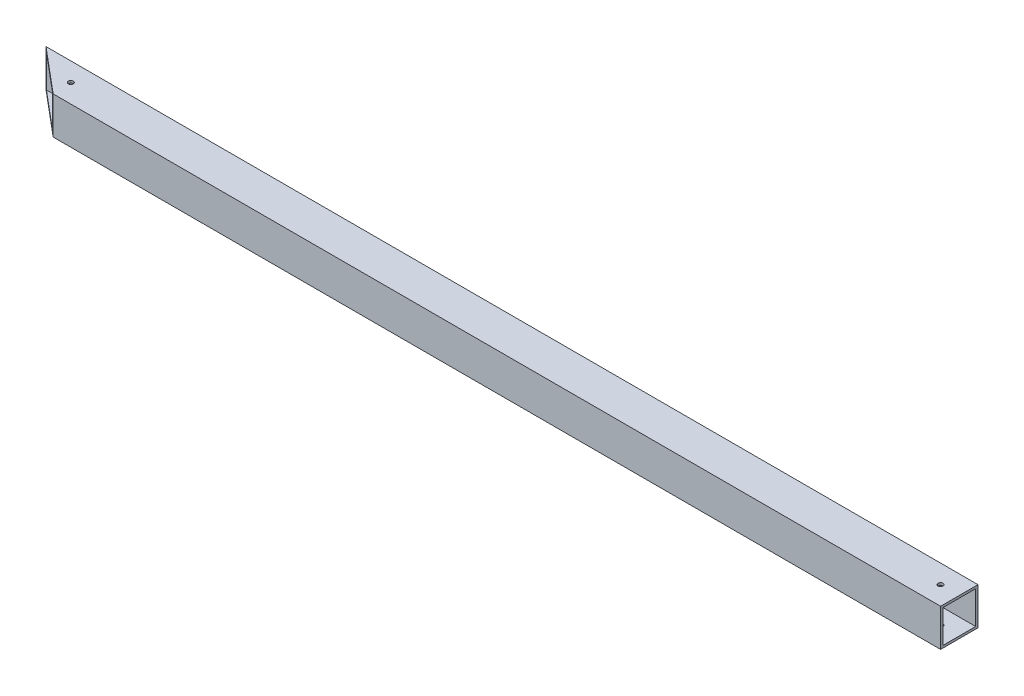
ISO-10303-21;
HEADER;
FILE_DESCRIPTION(('STEP AP214'),'2;1');
FILE_NAME('part.step','',(''),(''),'','','');
FILE_SCHEMA(('AUTOMOTIVE_DESIGN { 1 0 10303 214 1 1 1 1 }'));
ENDSEC;
DATA;
#1=APPLICATION_CONTEXT('core data for automotive mechanical design processes');
#2=APPLICATION_PROTOCOL_DEFINITION('international standard','automotive_design',2000,#1);
#3=PRODUCT_CONTEXT('',#1,'mechanical');
#4=PRODUCT('Part','Part','',(#3));
#5=PRODUCT_RELATED_PRODUCT_CATEGORY('part','',(#4));
#6=PRODUCT_DEFINITION_FORMATION('','',#4);
#7=PRODUCT_DEFINITION_CONTEXT('part definition',#1,'design');
#8=PRODUCT_DEFINITION('design','',#6,#7);
#9=PRODUCT_DEFINITION_SHAPE('','',#8);
#10=(LENGTH_UNIT() NAMED_UNIT(*) SI_UNIT(.MILLI.,.METRE.));
#11=(NAMED_UNIT(*) PLANE_ANGLE_UNIT() SI_UNIT($,.RADIAN.));
#12=(NAMED_UNIT(*) SI_UNIT($,.STERADIAN.) SOLID_ANGLE_UNIT());
#13=UNCERTAINTY_MEASURE_WITH_UNIT(LENGTH_MEASURE(1.E-05),#10,'distance_accuracy_value','');
#14=(GEOMETRIC_REPRESENTATION_CONTEXT(3) GLOBAL_UNCERTAINTY_ASSIGNED_CONTEXT((#13)) GLOBAL_UNIT_ASSIGNED_CONTEXT((#10,
#11,#12)) REPRESENTATION_CONTEXT('',''));
#15=CARTESIAN_POINT('',(0.,0.,0.));
#16=DIRECTION('',(0.,0.,1.));
#17=DIRECTION('',(1.,0.,0.));
#18=AXIS2_PLACEMENT_3D('',#15,#16,#17);
#19=CARTESIAN_POINT('',(1434.71069902318,-215.9,1156.61312053318));
#20=DIRECTION('',(1.,0.,0.));
#21=DIRECTION('',(0.,0.,-1.));
#22=AXIS2_PLACEMENT_3D('',#19,#20,#21);
#23=PLANE('',#22);
#24=DIRECTION('',(0.,0.,-1.));
#25=VECTOR('',#24,1.);
#26=CARTESIAN_POINT('',(1434.71069902318,-165.1,1156.61312053318));
#27=LINE('',#26,#25);
#28=CARTESIAN_POINT('',(1434.71069902318,-165.1,177.8));
#29=VERTEX_POINT('',#28);
#30=CARTESIAN_POINT('',(1434.71069902318,-165.1,127.));
#31=VERTEX_POINT('',#30);
#32=EDGE_CURVE('E176',#29,#31,#27,.T.);
#33=ORIENTED_EDGE('',*,*,#32,.F.);
#34=DIRECTION('',(0.,1.,0.));
#35=VECTOR('',#34,1.);
#36=CARTESIAN_POINT('',(1434.71069902318,-215.9,177.8));
#37=LINE('',#36,#35);
#38=CARTESIAN_POINT('',(1434.71069902318,-215.9,177.8));
#39=VERTEX_POINT('',#38);
#40=EDGE_CURVE('E24',#39,#29,#37,.T.);
#41=ORIENTED_EDGE('',*,*,#40,.F.);
#42=DIRECTION('',(0.,0.,-1.));
#43=VECTOR('',#42,1.);
#44=CARTESIAN_POINT('',(1434.71069902318,-215.9,1156.61312053318));
#45=LINE('',#44,#43);
#46=CARTESIAN_POINT('',(1434.71069902318,-215.9,127.));
#47=VERTEX_POINT('',#46);
#48=EDGE_CURVE('E160',#39,#47,#45,.T.);
#49=ORIENTED_EDGE('',*,*,#48,.T.);
#50=DIRECTION('',(0.,1.,0.));
#51=VECTOR('',#50,1.);
#52=CARTESIAN_POINT('',(1434.71069902318,-215.9,127.));
#53=LINE('',#52,#51);
#54=EDGE_CURVE('E185',#47,#31,#53,.T.);
#55=ORIENTED_EDGE('',*,*,#54,.T.);
#56=EDGE_LOOP('',(#33,#41,#49,#55));
#57=FACE_BOUND('',#56,.T.);
#58=DIRECTION('',(0.,1.,0.));
#59=VECTOR('',#58,1.);
#60=CARTESIAN_POINT('',(1434.71069902318,-215.9,174.625));
#61=LINE('',#60,#59);
#62=CARTESIAN_POINT('',(1434.71069902318,-212.725,174.625));
#63=VERTEX_POINT('',#62);
#64=CARTESIAN_POINT('',(1434.71069902318,-168.275,174.625));
#65=VERTEX_POINT('',#64);
#66=EDGE_CURVE('E112',#63,#65,#61,.T.);
#67=ORIENTED_EDGE('',*,*,#66,.T.);
#68=DIRECTION('',(0.,0.,-1.));
#69=VECTOR('',#68,1.);
#70=CARTESIAN_POINT('',(1434.71069902318,-168.275,637.655198226429));
#71=LINE('',#70,#69);
#72=CARTESIAN_POINT('',(1434.71069902318,-168.275,130.175));
#73=VERTEX_POINT('',#72);
#74=EDGE_CURVE('E121',#65,#73,#71,.T.);
#75=ORIENTED_EDGE('',*,*,#74,.T.);
#76=DIRECTION('',(0.,1.,0.));
#77=VECTOR('',#76,1.);
#78=CARTESIAN_POINT('',(1434.71069902318,-215.9,130.175));
#79=LINE('',#78,#77);
#80=CARTESIAN_POINT('',(1434.71069902318,-212.725,130.175));
#81=VERTEX_POINT('',#80);
#82=EDGE_CURVE('E139',#81,#73,#79,.T.);
#83=ORIENTED_EDGE('',*,*,#82,.F.);
#84=DIRECTION('',(0.,0.,-1.));
#85=VECTOR('',#84,1.);
#86=CARTESIAN_POINT('',(1434.71069902318,-212.725,637.655198226429));
#87=LINE('',#86,#85);
#88=EDGE_CURVE('E144',#63,#81,#87,.T.);
#89=ORIENTED_EDGE('',*,*,#88,.F.);
#90=EDGE_LOOP('',(#67,#75,#83,#89));
#91=FACE_BOUND('',#90,.T.);
#92=ADVANCED_FACE('F14',(#57,#91),#23,.T.);
#93=CARTESIAN_POINT('',(168.755680010826,-215.9,126.74379662104));
#94=DIRECTION('',(0.64278760968654,0.,-0.766044443118978));
#95=DIRECTION('',(-0.766044443118978,0.,-0.64278760968654));
#96=AXIS2_PLACEMENT_3D('',#93,#94,#95);
#97=PLANE('',#96);
#98=DIRECTION('',(-0.766044443118978,0.,-0.64278760968654));
#99=VECTOR('',#98,1.);
#100=CARTESIAN_POINT('',(168.755680010826,-165.1,126.74379662104));
#101=LINE('',#100,#99);
#102=CARTESIAN_POINT('',(229.602093811922,-165.1,177.8));
#103=VERTEX_POINT('',#102);
#104=CARTESIAN_POINT('',(169.061011308136,-165.1,127.));
#105=VERTEX_POINT('',#104);
#106=EDGE_CURVE('E111',#103,#105,#101,.T.);
#107=ORIENTED_EDGE('',*,*,#106,.T.);
#108=DIRECTION('',(0.,1.,0.));
#109=VECTOR('',#108,1.);
#110=CARTESIAN_POINT('',(169.061011308136,-215.9,127.));
#111=LINE('',#110,#109);
#112=CARTESIAN_POINT('',(169.061011308136,-215.9,127.));
#113=VERTEX_POINT('',#112);
#114=EDGE_CURVE('E168',#113,#105,#111,.T.);
#115=ORIENTED_EDGE('',*,*,#114,.F.);
#116=DIRECTION('',(-0.766044443118978,0.,-0.64278760968654));
#117=VECTOR('',#116,1.);
#118=CARTESIAN_POINT('',(168.755680010826,-215.9,126.74379662104));
#119=LINE('',#118,#117);
#120=CARTESIAN_POINT('',(229.602093811922,-215.9,177.8));
#121=VERTEX_POINT('',#120);
#122=EDGE_CURVE('E151',#121,#113,#119,.T.);
#123=ORIENTED_EDGE('',*,*,#122,.F.);
#124=DIRECTION('',(0.,1.,0.));
#125=VECTOR('',#124,1.);
#126=CARTESIAN_POINT('',(229.602093811922,-215.9,177.8));
#127=LINE('',#126,#125);
#128=EDGE_CURVE('E9',#121,#103,#127,.T.);
#129=ORIENTED_EDGE('',*,*,#128,.T.);
#130=EDGE_LOOP('',(#107,#115,#123,#129));
#131=FACE_BOUND('',#130,.T.);
#132=DIRECTION('',(-0.766044443118978,0.,-0.64278760968654));
#133=VECTOR('',#132,1.);
#134=CARTESIAN_POINT('',(735.042836195444,-168.275,601.915140515985));
#135=LINE('',#134,#133);
#136=CARTESIAN_POINT('',(225.818276155435,-168.275,174.625));
#137=VERTEX_POINT('',#136);
#138=CARTESIAN_POINT('',(172.844828964622,-168.275,130.175));
#139=VERTEX_POINT('',#138);
#140=EDGE_CURVE('E118',#137,#139,#135,.T.);
#141=ORIENTED_EDGE('',*,*,#140,.F.);
#142=DIRECTION('',(0.,1.,0.));
#143=VECTOR('',#142,1.);
#144=CARTESIAN_POINT('',(225.818276155435,-215.9,174.625));
#145=LINE('',#144,#143);
#146=CARTESIAN_POINT('',(225.818276155435,-212.725,174.625));
#147=VERTEX_POINT('',#146);
#148=EDGE_CURVE('E102',#147,#137,#145,.T.);
#149=ORIENTED_EDGE('',*,*,#148,.F.);
#150=DIRECTION('',(-0.766044443118978,0.,-0.64278760968654));
#151=VECTOR('',#150,1.);
#152=CARTESIAN_POINT('',(735.042836195444,-212.725,601.915140515985));
#153=LINE('',#152,#151);
#154=CARTESIAN_POINT('',(172.844828964622,-212.725,130.175));
#155=VERTEX_POINT('',#154);
#156=EDGE_CURVE('E47',#147,#155,#153,.T.);
#157=ORIENTED_EDGE('',*,*,#156,.T.);
#158=DIRECTION('',(0.,1.,0.));
#159=VECTOR('',#158,1.);
#160=CARTESIAN_POINT('',(172.844828964622,-215.9,130.175));
#161=LINE('',#160,#159);
#162=EDGE_CURVE('E124',#155,#139,#161,.T.);
#163=ORIENTED_EDGE('',*,*,#162,.T.);
#164=EDGE_LOOP('',(#141,#149,#157,#163));
#165=FACE_BOUND('',#164,.T.);
#166=ADVANCED_FACE('F16',(#131,#165),#97,.F.);
#167=CARTESIAN_POINT('',(686.616627278044,-215.9,177.8));
#168=DIRECTION('',(0.,0.,-1.));
#169=DIRECTION('',(-1.,0.,0.));
#170=AXIS2_PLACEMENT_3D('',#167,#168,#169);
#171=PLANE('',#170);
#172=DIRECTION('',(-1.,0.,0.));
#173=VECTOR('',#172,1.);
#174=CARTESIAN_POINT('',(686.616627278044,-165.1,177.8));
#175=LINE('',#174,#173);
#176=EDGE_CURVE('E172',#29,#103,#175,.T.);
#177=ORIENTED_EDGE('',*,*,#176,.T.);
#178=ORIENTED_EDGE('',*,*,#128,.F.);
#179=DIRECTION('',(-1.,0.,0.));
#180=VECTOR('',#179,1.);
#181=CARTESIAN_POINT('',(686.616627278044,-215.9,177.8));
#182=LINE('',#181,#180);
#183=EDGE_CURVE('E155',#39,#121,#182,.T.);
#184=ORIENTED_EDGE('',*,*,#183,.F.);
#185=ORIENTED_EDGE('',*,*,#40,.T.);
#186=EDGE_LOOP('',(#177,#178,#184,#185));
#187=FACE_BOUND('',#186,.T.);
#188=ADVANCED_FACE('F242',(#187),#171,.F.);
#189=CARTESIAN_POINT('',(661.181740408425,-215.9,127.));
#190=DIRECTION('',(0.,0.,1.));
#191=DIRECTION('',(1.,0.,0.));
#192=AXIS2_PLACEMENT_3D('',#189,#190,#191);
#193=PLANE('',#192);
#194=DIRECTION('',(1.,0.,0.));
#195=VECTOR('',#194,1.);
#196=CARTESIAN_POINT('',(661.181740408425,-165.1,127.));
#197=LINE('',#196,#195);
#198=EDGE_CURVE('E156',#105,#31,#197,.T.);
#199=ORIENTED_EDGE('',*,*,#198,.T.);
#200=ORIENTED_EDGE('',*,*,#54,.F.);
#201=DIRECTION('',(1.,0.,0.));
#202=VECTOR('',#201,1.);
#203=CARTESIAN_POINT('',(661.181740408425,-215.9,127.));
#204=LINE('',#203,#202);
#205=EDGE_CURVE('E164',#113,#47,#204,.T.);
#206=ORIENTED_EDGE('',*,*,#205,.F.);
#207=ORIENTED_EDGE('',*,*,#114,.T.);
#208=EDGE_LOOP('',(#199,#200,#206,#207));
#209=FACE_BOUND('',#208,.T.);
#210=ADVANCED_FACE('F246',(#209),#193,.F.);
#211=CARTESIAN_POINT('',(705.053366952356,-215.9,637.655198226429));
#212=DIRECTION('',(0.,1.,0.));
#213=DIRECTION('',(-1.,0.,0.));
#214=AXIS2_PLACEMENT_3D('',#211,#212,#213);
#215=PLANE('',#214);
#216=CARTESIAN_POINT('',(228.210699023183,-215.9,152.4));
#217=DIRECTION('',(0.,-1.,0.));
#218=DIRECTION('',(0.,0.,-1.));
#219=AXIS2_PLACEMENT_3D('',#216,#217,#218);
#220=CIRCLE('',#219,3.3782);
#221=CARTESIAN_POINT('',(228.210699023183,-215.9,149.0218));
#222=VERTEX_POINT('',#221);
#223=EDGE_CURVE('E275',#222,#222,#220,.T.);
#224=ORIENTED_EDGE('',*,*,#223,.F.);
#225=EDGE_LOOP('',(#224));
#226=FACE_BOUND('',#225,.T.);
#227=CARTESIAN_POINT('',(1409.31069902318,-215.9,152.4));
#228=DIRECTION('',(0.,1.,0.));
#229=DIRECTION('',(0.,0.,1.));
#230=AXIS2_PLACEMENT_3D('',#227,#228,#229);
#231=CIRCLE('',#230,3.36549999999991);
#232=CARTESIAN_POINT('',(1409.31069902318,-215.9,155.7655));
#233=VERTEX_POINT('',#232);
#234=EDGE_CURVE('E126',#233,#233,#231,.F.);
#235=ORIENTED_EDGE('',*,*,#234,.F.);
#236=EDGE_LOOP('',(#235));
#237=FACE_BOUND('',#236,.T.);
#238=ORIENTED_EDGE('',*,*,#122,.T.);
#239=ORIENTED_EDGE('',*,*,#205,.T.);
#240=ORIENTED_EDGE('',*,*,#48,.F.);
#241=ORIENTED_EDGE('',*,*,#183,.T.);
#242=EDGE_LOOP('',(#238,#239,#240,#241));
#243=FACE_BOUND('',#242,.T.);
#244=ADVANCED_FACE('F253',(#226,#237,#243),#215,.F.);
#245=CARTESIAN_POINT('',(705.053366952356,-165.1,637.655198226429));
#246=DIRECTION('',(0.,1.,0.));
#247=DIRECTION('',(-1.,0.,0.));
#248=AXIS2_PLACEMENT_3D('',#245,#246,#247);
#249=PLANE('',#248);
#250=CARTESIAN_POINT('',(228.210699023183,-165.1,152.4));
#251=DIRECTION('',(0.,1.,0.));
#252=DIRECTION('',(0.,0.,1.));
#253=AXIS2_PLACEMENT_3D('',#250,#251,#252);
#254=CIRCLE('',#253,3.3782);
#255=CARTESIAN_POINT('',(228.210699023183,-165.1,155.7782));
#256=VERTEX_POINT('',#255);
#257=EDGE_CURVE('E201',#256,#256,#254,.F.);
#258=ORIENTED_EDGE('',*,*,#257,.T.);
#259=EDGE_LOOP('',(#258));
#260=FACE_BOUND('',#259,.T.);
#261=CARTESIAN_POINT('',(1409.31069902318,-165.1,152.4));
#262=DIRECTION('',(0.,1.,0.));
#263=DIRECTION('',(0.,0.,1.));
#264=AXIS2_PLACEMENT_3D('',#261,#262,#263);
#265=CIRCLE('',#264,3.36549999999991);
#266=CARTESIAN_POINT('',(1409.31069902318,-165.1,155.7655));
#267=VERTEX_POINT('',#266);
#268=EDGE_CURVE('E192',#267,#267,#265,.T.);
#269=ORIENTED_EDGE('',*,*,#268,.F.);
#270=EDGE_LOOP('',(#269));
#271=FACE_BOUND('',#270,.T.);
#272=ORIENTED_EDGE('',*,*,#106,.F.);
#273=ORIENTED_EDGE('',*,*,#176,.F.);
#274=ORIENTED_EDGE('',*,*,#32,.T.);
#275=ORIENTED_EDGE('',*,*,#198,.F.);
#276=EDGE_LOOP('',(#272,#273,#274,#275));
#277=FACE_BOUND('',#276,.T.);
#278=ADVANCED_FACE('F260',(#260,#271,#277),#249,.T.);
#279=CARTESIAN_POINT('',(686.616627278044,-215.9,174.625));
#280=DIRECTION('',(0.,0.,-1.));
#281=DIRECTION('',(-1.,0.,0.));
#282=AXIS2_PLACEMENT_3D('',#279,#280,#281);
#283=PLANE('',#282);
#284=DIRECTION('',(-1.,0.,0.));
#285=VECTOR('',#284,1.);
#286=CARTESIAN_POINT('',(705.053366952356,-168.275,174.625));
#287=LINE('',#286,#285);
#288=EDGE_CURVE('E105',#65,#137,#287,.T.);
#289=ORIENTED_EDGE('',*,*,#288,.F.);
#290=ORIENTED_EDGE('',*,*,#66,.F.);
#291=DIRECTION('',(-1.,0.,0.));
#292=VECTOR('',#291,1.);
#293=CARTESIAN_POINT('',(705.053366952356,-212.725,174.625));
#294=LINE('',#293,#292);
#295=EDGE_CURVE('E107',#63,#147,#294,.T.);
#296=ORIENTED_EDGE('',*,*,#295,.T.);
#297=ORIENTED_EDGE('',*,*,#148,.T.);
#298=EDGE_LOOP('',(#289,#290,#296,#297));
#299=FACE_BOUND('',#298,.T.);
#300=ADVANCED_FACE('F104',(#299),#283,.T.);
#301=CARTESIAN_POINT('',(661.181740408425,-215.9,130.175));
#302=DIRECTION('',(0.,0.,1.));
#303=DIRECTION('',(1.,0.,0.));
#304=AXIS2_PLACEMENT_3D('',#301,#302,#303);
#305=PLANE('',#304);
#306=DIRECTION('',(1.,0.,0.));
#307=VECTOR('',#306,1.);
#308=CARTESIAN_POINT('',(705.053366952356,-168.275,130.175));
#309=LINE('',#308,#307);
#310=EDGE_CURVE('E141',#139,#73,#309,.T.);
#311=ORIENTED_EDGE('',*,*,#310,.F.);
#312=ORIENTED_EDGE('',*,*,#162,.F.);
#313=DIRECTION('',(1.,0.,0.));
#314=VECTOR('',#313,1.);
#315=CARTESIAN_POINT('',(705.053366952356,-212.725,130.175));
#316=LINE('',#315,#314);
#317=EDGE_CURVE('E37',#155,#81,#316,.T.);
#318=ORIENTED_EDGE('',*,*,#317,.T.);
#319=ORIENTED_EDGE('',*,*,#82,.T.);
#320=EDGE_LOOP('',(#311,#312,#318,#319));
#321=FACE_BOUND('',#320,.T.);
#322=ADVANCED_FACE('F222',(#321),#305,.T.);
#323=CARTESIAN_POINT('',(705.053366952356,-212.725,637.655198226429));
#324=DIRECTION('',(0.,1.,0.));
#325=DIRECTION('',(-1.,0.,0.));
#326=AXIS2_PLACEMENT_3D('',#323,#324,#325);
#327=PLANE('',#326);
#328=CARTESIAN_POINT('',(228.210699023183,-212.725,152.4));
#329=DIRECTION('',(0.,1.,0.));
#330=DIRECTION('',(0.,0.,1.));
#331=AXIS2_PLACEMENT_3D('',#328,#329,#330);
#332=CIRCLE('',#331,3.3782);
#333=CARTESIAN_POINT('',(228.210699023183,-212.725,155.7782));
#334=VERTEX_POINT('',#333);
#335=EDGE_CURVE('E209',#334,#334,#332,.F.);
#336=ORIENTED_EDGE('',*,*,#335,.T.);
#337=EDGE_LOOP('',(#336));
#338=FACE_BOUND('',#337,.T.);
#339=CARTESIAN_POINT('',(1409.31069902318,-212.725,152.4));
#340=DIRECTION('',(0.,1.,0.));
#341=DIRECTION('',(0.,0.,1.));
#342=AXIS2_PLACEMENT_3D('',#339,#340,#341);
#343=CIRCLE('',#342,3.36549999999991);
#344=CARTESIAN_POINT('',(1409.31069902318,-212.725,155.7655));
#345=VERTEX_POINT('',#344);
#346=EDGE_CURVE('E133',#345,#345,#343,.F.);
#347=ORIENTED_EDGE('',*,*,#346,.T.);
#348=EDGE_LOOP('',(#347));
#349=FACE_BOUND('',#348,.T.);
#350=ORIENTED_EDGE('',*,*,#156,.F.);
#351=ORIENTED_EDGE('',*,*,#295,.F.);
#352=ORIENTED_EDGE('',*,*,#88,.T.);
#353=ORIENTED_EDGE('',*,*,#317,.F.);
#354=EDGE_LOOP('',(#350,#351,#352,#353));
#355=FACE_BOUND('',#354,.T.);
#356=ADVANCED_FACE('F220',(#338,#349,#355),#327,.T.);
#357=CARTESIAN_POINT('',(705.053366952356,-168.275,637.655198226429));
#358=DIRECTION('',(0.,1.,0.));
#359=DIRECTION('',(-1.,0.,0.));
#360=AXIS2_PLACEMENT_3D('',#357,#358,#359);
#361=PLANE('',#360);
#362=CARTESIAN_POINT('',(228.210699023183,-168.275,152.4));
#363=DIRECTION('',(0.,1.,0.));
#364=DIRECTION('',(0.,0.,1.));
#365=AXIS2_PLACEMENT_3D('',#362,#363,#364);
#366=CIRCLE('',#365,3.3782);
#367=CARTESIAN_POINT('',(228.210699023183,-168.275,155.7782));
#368=VERTEX_POINT('',#367);
#369=EDGE_CURVE('E18',#368,#368,#366,.F.);
#370=ORIENTED_EDGE('',*,*,#369,.F.);
#371=EDGE_LOOP('',(#370));
#372=FACE_BOUND('',#371,.T.);
#373=CARTESIAN_POINT('',(1409.31069902318,-168.275,152.4));
#374=DIRECTION('',(0.,1.,0.));
#375=DIRECTION('',(0.,0.,1.));
#376=AXIS2_PLACEMENT_3D('',#373,#374,#375);
#377=CIRCLE('',#376,3.36549999999991);
#378=CARTESIAN_POINT('',(1409.31069902318,-168.275,155.7655));
#379=VERTEX_POINT('',#378);
#380=EDGE_CURVE('E189',#379,#379,#377,.F.);
#381=ORIENTED_EDGE('',*,*,#380,.F.);
#382=EDGE_LOOP('',(#381));
#383=FACE_BOUND('',#382,.T.);
#384=ORIENTED_EDGE('',*,*,#140,.T.);
#385=ORIENTED_EDGE('',*,*,#310,.T.);
#386=ORIENTED_EDGE('',*,*,#74,.F.);
#387=ORIENTED_EDGE('',*,*,#288,.T.);
#388=EDGE_LOOP('',(#384,#385,#386,#387));
#389=FACE_BOUND('',#388,.T.);
#390=ADVANCED_FACE('F116',(#372,#383,#389),#361,.F.);
#391=CARTESIAN_POINT('',(1409.31069902318,-1433.79813056647,152.4));
#392=DIRECTION('',(0.,1.,0.));
#393=DIRECTION('',(0.,0.,1.));
#394=AXIS2_PLACEMENT_3D('',#391,#392,#393);
#395=CYLINDRICAL_SURFACE('',#394,3.36549999999991);
#396=ORIENTED_EDGE('',*,*,#268,.T.);
#397=EDGE_LOOP('',(#396));
#398=FACE_BOUND('',#397,.T.);
#399=ORIENTED_EDGE('',*,*,#380,.T.);
#400=EDGE_LOOP('',(#399));
#401=FACE_BOUND('',#400,.T.);
#402=ADVANCED_FACE('F230',(#398,#401),#395,.F.);
#403=ORIENTED_EDGE('',*,*,#346,.F.);
#404=EDGE_LOOP('',(#403));
#405=FACE_BOUND('',#404,.T.);
#406=ORIENTED_EDGE('',*,*,#234,.T.);
#407=EDGE_LOOP('',(#406));
#408=FACE_BOUND('',#407,.T.);
#409=ADVANCED_FACE('F278',(#405,#408),#395,.F.);
#410=CARTESIAN_POINT('',(228.210699023183,1715.91155852403,152.4));
#411=DIRECTION('',(0.,-1.,0.));
#412=DIRECTION('',(0.,0.,-1.));
#413=AXIS2_PLACEMENT_3D('',#410,#411,#412);
#414=CYLINDRICAL_SURFACE('',#413,3.3782);
#415=ORIENTED_EDGE('',*,*,#257,.F.);
#416=EDGE_LOOP('',(#415));
#417=FACE_BOUND('',#416,.T.);
#418=ORIENTED_EDGE('',*,*,#369,.T.);
#419=EDGE_LOOP('',(#418));
#420=FACE_BOUND('',#419,.T.);
#421=ADVANCED_FACE('F280',(#417,#420),#414,.F.);
#422=ORIENTED_EDGE('',*,*,#335,.F.);
#423=EDGE_LOOP('',(#422));
#424=FACE_BOUND('',#423,.T.);
#425=ORIENTED_EDGE('',*,*,#223,.T.);
#426=EDGE_LOOP('',(#425));
#427=FACE_BOUND('',#426,.T.);
#428=ADVANCED_FACE('F287',(#424,#427),#414,.F.);
#429=CLOSED_SHELL('',(#92,#166,#188,#210,#244,#278,#300,#322,#356,#390,#402,#409,#421,#428));
#430=MANIFOLD_SOLID_BREP('B1',#429);
#431=ADVANCED_BREP_SHAPE_REPRESENTATION('',(#18,#430),#14);
#432=SHAPE_DEFINITION_REPRESENTATION(#9,#431);
ENDSEC;
END-ISO-10303-21;
